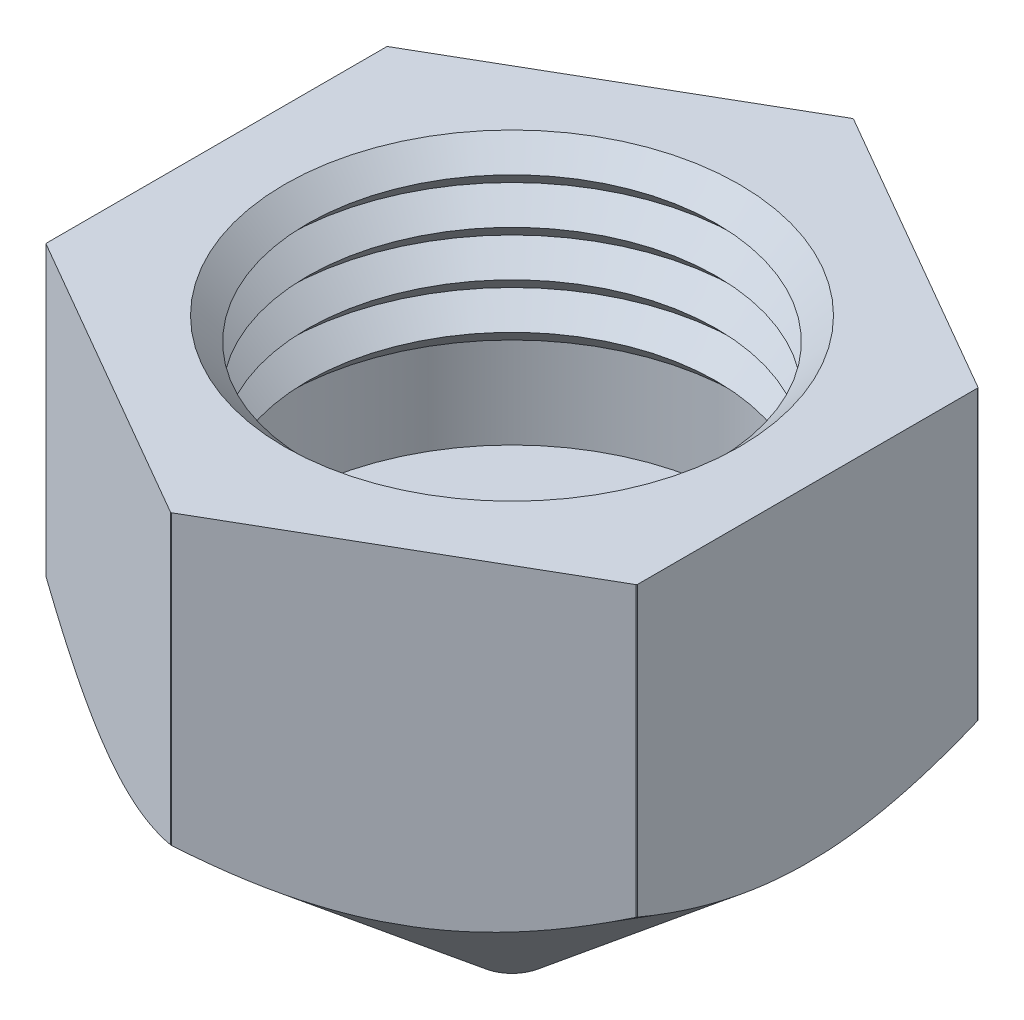
ISO-10303-21;
HEADER;
FILE_DESCRIPTION(('STEP AP214'),'2;1');
FILE_NAME('part.step','',(''),(''),'','','');
FILE_SCHEMA(('AUTOMOTIVE_DESIGN { 1 0 10303 214 1 1 1 1 }'));
ENDSEC;
DATA;
#1=APPLICATION_CONTEXT('core data for automotive mechanical design processes');
#2=APPLICATION_PROTOCOL_DEFINITION('international standard','automotive_design',2000,#1);
#3=PRODUCT_CONTEXT('',#1,'mechanical');
#4=PRODUCT('Part','Part','',(#3));
#5=PRODUCT_RELATED_PRODUCT_CATEGORY('part','',(#4));
#6=PRODUCT_DEFINITION_FORMATION('','',#4);
#7=PRODUCT_DEFINITION_CONTEXT('part definition',#1,'design');
#8=PRODUCT_DEFINITION('design','',#6,#7);
#9=PRODUCT_DEFINITION_SHAPE('','',#8);
#10=(LENGTH_UNIT() NAMED_UNIT(*) SI_UNIT(.MILLI.,.METRE.));
#11=(NAMED_UNIT(*) PLANE_ANGLE_UNIT() SI_UNIT($,.RADIAN.));
#12=(NAMED_UNIT(*) SI_UNIT($,.STERADIAN.) SOLID_ANGLE_UNIT());
#13=UNCERTAINTY_MEASURE_WITH_UNIT(LENGTH_MEASURE(1.E-05),#10,'distance_accuracy_value','');
#14=(GEOMETRIC_REPRESENTATION_CONTEXT(3) GLOBAL_UNCERTAINTY_ASSIGNED_CONTEXT((#13)) GLOBAL_UNIT_ASSIGNED_CONTEXT((#10,
#11,#12)) REPRESENTATION_CONTEXT('',''));
#15=CARTESIAN_POINT('',(0.,0.,0.));
#16=DIRECTION('',(0.,0.,1.));
#17=DIRECTION('',(1.,0.,0.));
#18=AXIS2_PLACEMENT_3D('',#15,#16,#17);
#19=CARTESIAN_POINT('',(7.5,0.,0.));
#20=DIRECTION('',(0.,-1.,0.));
#21=DIRECTION('',(0.,0.,-1.));
#22=AXIS2_PLACEMENT_3D('',#19,#20,#21);
#23=PLANE('',#22);
#24=CARTESIAN_POINT('',(0.,0.,0.));
#25=DIRECTION('',(0.,1.,0.));
#26=DIRECTION('',(0.,0.,1.));
#27=AXIS2_PLACEMENT_3D('',#24,#25,#26);
#28=CIRCLE('',#27,5.);
#29=CARTESIAN_POINT('',(0.,0.,5.));
#30=VERTEX_POINT('',#29);
#31=EDGE_CURVE('E256',#30,#30,#28,.T.);
#32=ORIENTED_EDGE('',*,*,#31,.F.);
#33=EDGE_LOOP('',(#32));
#34=FACE_BOUND('',#33,.T.);
#35=DIRECTION('',(-0.866025403784439,0.,-0.5));
#36=VECTOR('',#35,1.);
#37=CARTESIAN_POINT('',(6.49999999999999,0.,-3.75277674973257));
#38=LINE('',#37,#36);
#39=CARTESIAN_POINT('',(6.49037034920393,0.,-3.75833643121188));
#40=VERTEX_POINT('',#39);
#41=CARTESIAN_POINT('',(0.00962965079606866,0.,-7.49999381798582));
#42=VERTEX_POINT('',#41);
#43=EDGE_CURVE('E187',#40,#42,#38,.T.);
#44=ORIENTED_EDGE('',*,*,#43,.T.);
#45=CARTESIAN_POINT('',(0.,0.,0.));
#46=DIRECTION('',(0.,1.,0.));
#47=DIRECTION('',(0.,0.,1.));
#48=AXIS2_PLACEMENT_3D('',#45,#46,#47);
#49=CIRCLE('',#48,7.5);
#50=CARTESIAN_POINT('',(-0.00962965079606779,0.,-7.49999381798582));
#51=VERTEX_POINT('',#50);
#52=EDGE_CURVE('E186',#42,#51,#49,.T.);
#53=ORIENTED_EDGE('',*,*,#52,.T.);
#54=DIRECTION('',(-0.866025403784439,0.,0.5));
#55=VECTOR('',#54,1.);
#56=CARTESIAN_POINT('',(0.,0.,-7.50555349946513));
#57=LINE('',#56,#55);
#58=CARTESIAN_POINT('',(-6.49037034920393,0.,-3.75833643121188));
#59=VERTEX_POINT('',#58);
#60=EDGE_CURVE('E169',#51,#59,#57,.T.);
#61=ORIENTED_EDGE('',*,*,#60,.T.);
#62=CARTESIAN_POINT('',(-6.5,0.,-3.74165738677395));
#63=VERTEX_POINT('',#62);
#64=EDGE_CURVE('E184',#59,#63,#49,.T.);
#65=ORIENTED_EDGE('',*,*,#64,.T.);
#66=DIRECTION('',(0.,0.,1.));
#67=VECTOR('',#66,1.);
#68=CARTESIAN_POINT('',(-6.5,0.,-3.75277674973257));
#69=LINE('',#68,#67);
#70=CARTESIAN_POINT('',(-6.5,0.,3.74165738677395));
#71=VERTEX_POINT('',#70);
#72=EDGE_CURVE('E102',#63,#71,#69,.T.);
#73=ORIENTED_EDGE('',*,*,#72,.T.);
#74=CARTESIAN_POINT('',(-6.49037034920393,0.,3.75833643121188));
#75=VERTEX_POINT('',#74);
#76=EDGE_CURVE('E190',#71,#75,#49,.T.);
#77=ORIENTED_EDGE('',*,*,#76,.T.);
#78=DIRECTION('',(0.866025403784439,0.,0.5));
#79=VECTOR('',#78,1.);
#80=CARTESIAN_POINT('',(-6.5,0.,3.75277674973257));
#81=LINE('',#80,#79);
#82=CARTESIAN_POINT('',(-0.00962965079606432,0.,7.49999381798582));
#83=VERTEX_POINT('',#82);
#84=EDGE_CURVE('E94',#75,#83,#81,.T.);
#85=ORIENTED_EDGE('',*,*,#84,.T.);
#86=CARTESIAN_POINT('',(0.00962965079606215,0.,7.49999381798582));
#87=VERTEX_POINT('',#86);
#88=EDGE_CURVE('E194',#83,#87,#49,.T.);
#89=ORIENTED_EDGE('',*,*,#88,.T.);
#90=DIRECTION('',(0.866025403784439,0.,-0.5));
#91=VECTOR('',#90,1.);
#92=CARTESIAN_POINT('',(0.,0.,7.50555349946513));
#93=LINE('',#92,#91);
#94=CARTESIAN_POINT('',(6.49037034920393,0.,3.75833643121188));
#95=VERTEX_POINT('',#94);
#96=EDGE_CURVE('E351',#87,#95,#93,.T.);
#97=ORIENTED_EDGE('',*,*,#96,.T.);
#98=CARTESIAN_POINT('',(6.5,0.,3.74165738677395));
#99=VERTEX_POINT('',#98);
#100=EDGE_CURVE('E199',#95,#99,#49,.T.);
#101=ORIENTED_EDGE('',*,*,#100,.T.);
#102=DIRECTION('',(0.,0.,-1.));
#103=VECTOR('',#102,1.);
#104=CARTESIAN_POINT('',(6.49999999999999,0.,3.75277674973257));
#105=LINE('',#104,#103);
#106=CARTESIAN_POINT('',(6.49999999999999,0.,-3.74165738677395));
#107=VERTEX_POINT('',#106);
#108=EDGE_CURVE('E348',#99,#107,#105,.T.);
#109=ORIENTED_EDGE('',*,*,#108,.T.);
#110=EDGE_CURVE('E192',#107,#40,#49,.T.);
#111=ORIENTED_EDGE('',*,*,#110,.T.);
#112=EDGE_LOOP('',(#44,#53,#61,#65,#73,#77,#85,#89,#97,#101,#109,#111));
#113=FACE_BOUND('',#112,.T.);
#114=ADVANCED_FACE('F80',(#34,#113),#23,.F.);
#115=CARTESIAN_POINT('',(0.,-12.,0.));
#116=DIRECTION('',(0.,1.,0.));
#117=DIRECTION('',(0.,0.,1.));
#118=AXIS2_PLACEMENT_3D('',#115,#116,#117);
#119=CONICAL_SURFACE('',#118,0.750000000000002,0.872664625997159);
#120=CARTESIAN_POINT('',(0.,-12.,0.));
#121=DIRECTION('',(0.,1.,0.));
#122=DIRECTION('',(0.,0.,1.));
#123=AXIS2_PLACEMENT_3D('',#120,#121,#122);
#124=CIRCLE('',#123,0.750000000000002);
#125=CARTESIAN_POINT('',(0.,-12.,0.750000000000002));
#126=VERTEX_POINT('',#125);
#127=EDGE_CURVE('E211',#126,#126,#124,.T.);
#128=ORIENTED_EDGE('',*,*,#127,.T.);
#129=EDGE_LOOP('',(#128));
#130=FACE_BOUND('',#129,.T.);
#131=CARTESIAN_POINT('',(6.4907840854015,-6.3358774895533,-3.75809756050684));
#132=CARTESIAN_POINT('',(6.2721804860683,-6.44150504363962,-3.88430840742768));
#133=CARTESIAN_POINT('',(6.05090824172166,-6.54049745093145,-4.01205999726541));
#134=CARTESIAN_POINT('',(5.6024236351629,-6.72140092476843,-4.27099270558951));
#135=CARTESIAN_POINT('',(5.3751943925318,-6.80325577657467,-4.40218356999033));
#136=CARTESIAN_POINT('',(4.91770887370572,-6.94468746843998,-4.66631295743492));
#137=CARTESIAN_POINT('',(4.6874992998961,-7.00446124376274,-4.79922451684394));
#138=CARTESIAN_POINT('',(4.22337398919867,-7.09858830954557,-5.06718738991282));
#139=CARTESIAN_POINT('',(3.98946312385959,-7.13297256776506,-5.20223589098272));
#140=CARTESIAN_POINT('',(3.63527916695337,-7.16363913543257,-5.40672409384517));
#141=CARTESIAN_POINT('',(3.51563429740054,-7.17034133633155,-5.47580109148865));
#142=CARTESIAN_POINT('',(3.27619934370319,-7.17634872611789,-5.61403892645922));
#143=CARTESIAN_POINT('',(3.15640926458357,-7.17565416404938,-5.68319976088518));
#144=CARTESIAN_POINT('',(2.91698970106963,-7.16687178735822,-5.82142871032922));
#145=CARTESIAN_POINT('',(2.79736029310667,-7.15878121919445,-5.89049678121962));
#146=CARTESIAN_POINT('',(2.55862405517319,-7.1354002217659,-6.02833121245584));
#147=CARTESIAN_POINT('',(2.4395173025377,-7.12010876101713,-6.09709752815224));
#148=CARTESIAN_POINT('',(2.08348354616151,-7.0639108989015,-6.30265371323663));
#149=CARTESIAN_POINT('',(1.84774089337108,-7.01267680994404,-6.43875979728466));
#150=CARTESIAN_POINT('',(1.3810925435246,-6.88655390774963,-6.70817934768542));
#151=CARTESIAN_POINT('',(1.1501889234397,-6.81165515044308,-6.8414916148983));
#152=CARTESIAN_POINT('',(0.767152833619516,-6.6698225874224,-7.06263760446532));
#153=CARTESIAN_POINT('',(0.613552997711506,-6.60806447095064,-7.15131851107429));
#154=CARTESIAN_POINT('',(0.385278144896174,-6.5098769964684,-7.28311305879645));
#155=CARTESIAN_POINT('',(0.309677987212163,-6.47628972913643,-7.32676083018609));
#156=CARTESIAN_POINT('',(0.159046111364497,-6.40736914610989,-7.41372818425528));
#157=CARTESIAN_POINT('',(0.0840146000192753,-6.37203522728523,-7.45704764752815));
#158=CARTESIAN_POINT('',(0.00927253307190597,-6.33590486004536,-7.5002));
#159=B_SPLINE_CURVE_WITH_KNOTS('',3,(#131,#132,#133,#134,#135,#136,#137,#138,#139,#140,#141,
#142,#143,#144,#145,#146,#147,#148,#149,#150,#151,#152,#153,#154,#155,#156,#157,#158),
.UNSPECIFIED.,.F.,.F.,(4,2,2,2,2,2,2,2,2,2,2,2,2,4),(0.,0.821225631925539,1.64510425040092,
2.46144657798892,3.27679155533451,3.6915711315783,4.10633674251147,4.5212568340501,
4.93623637845141,5.76584307173045,6.59579883658509,7.15903293242023,7.43961821332753,
7.72030106833482),.UNSPECIFIED.);
#160=CARTESIAN_POINT('',(6.49037034920393,-6.3360774895533,-3.75833643121188));
#161=VERTEX_POINT('',#160);
#162=CARTESIAN_POINT('',(0.00962965079606854,-6.3360774895533,-7.49999381798582));
#163=VERTEX_POINT('',#162);
#164=EDGE_CURVE('E198',#161,#163,#159,.T.);
#165=ORIENTED_EDGE('',*,*,#164,.F.);
#166=CARTESIAN_POINT('',(0.,-6.3360774895533,0.));
#167=DIRECTION('',(0.,1.,0.));
#168=DIRECTION('',(0.,0.,1.));
#169=AXIS2_PLACEMENT_3D('',#166,#167,#168);
#170=CIRCLE('',#169,7.5);
#171=CARTESIAN_POINT('',(6.49999999999999,-6.3360774895533,-3.74165738677395));
#172=VERTEX_POINT('',#171);
#173=EDGE_CURVE('E288',#172,#161,#170,.T.);
#174=ORIENTED_EDGE('',*,*,#173,.F.);
#175=CARTESIAN_POINT('',(6.49999999999999,-4.18104789544403,-7.68894955295264));
#176=CARTESIAN_POINT('',(6.49999999999999,-4.30883968052177,-7.48947703416495));
#177=CARTESIAN_POINT('',(6.49999999999999,-4.43521184115085,-7.28907883452259));
#178=CARTESIAN_POINT('',(6.49999999999999,-4.68446334928344,-6.88605670814282));
#179=CARTESIAN_POINT('',(6.49999999999999,-4.80734183465251,-6.68343224884359));
#180=CARTESIAN_POINT('',(6.49999999999999,-5.04973450887114,-6.27425362063387));
#181=CARTESIAN_POINT('',(6.49999999999999,-5.16921913219222,-6.06768187355713));
#182=CARTESIAN_POINT('',(6.49999999999999,-5.40298006188188,-5.65162065291682));
#183=CARTESIAN_POINT('',(6.49999999999999,-5.51725671032909,-5.44213137217092));
#184=CARTESIAN_POINT('',(6.49999999999999,-5.74403711308446,-5.01105544712995));
#185=CARTESIAN_POINT('',(6.49999999999999,-5.85627224351079,-4.78932672998157));
#186=CARTESIAN_POINT('',(6.49999999999999,-6.07217151771746,-4.34167428480146));
#187=CARTESIAN_POINT('',(6.49999999999999,-6.17583459345196,-4.11575003830403));
#188=CARTESIAN_POINT('',(6.49999999999999,-6.37218593468881,-3.65985387342288));
#189=CARTESIAN_POINT('',(6.49999999999999,-6.46490263841359,-3.42989430967249));
#190=CARTESIAN_POINT('',(6.49999999999999,-6.63705130324292,-2.96509825794761));
#191=CARTESIAN_POINT('',(6.49999999999999,-6.716488123002,-2.73026358911358));
#192=CARTESIAN_POINT('',(6.49999999999999,-6.86088335837456,-2.24969389518852));
#193=CARTESIAN_POINT('',(6.49999999999999,-6.9254298074909,-2.00383314928939));
#194=CARTESIAN_POINT('',(6.49999999999999,-7.03400926189246,-1.50754517189571));
#195=CARTESIAN_POINT('',(6.49999999999999,-7.07804287233455,-1.25711807534128));
#196=CARTESIAN_POINT('',(6.49999999999999,-7.1421387124506,-0.757220847631535));
#197=CARTESIAN_POINT('',(6.49999999999999,-7.16257263339319,-0.507799333693213));
#198=CARTESIAN_POINT('',(6.49999999999999,-7.17919422186389,-0.00813670552531271));
#199=CARTESIAN_POINT('',(6.49999999999999,-7.17538285305941,0.242104375734128));
#200=CARTESIAN_POINT('',(6.49999999999999,-7.14463854484782,0.728125305135748));
#201=CARTESIAN_POINT('',(6.49999999999999,-7.11891135984899,0.96398384387337));
#202=CARTESIAN_POINT('',(6.49999999999999,-7.04762110659611,1.432642653543));
#203=CARTESIAN_POINT('',(6.49999999999999,-7.00205669897426,1.6654427168796));
#204=CARTESIAN_POINT('',(6.49999999999999,-6.89257432837353,2.1313773693949));
#205=CARTESIAN_POINT('',(6.49999999999999,-6.82831945544996,2.36443187709798));
#206=CARTESIAN_POINT('',(6.49999999999999,-6.72068043936283,2.71040336088851));
#207=CARTESIAN_POINT('',(6.49999999999999,-6.68292706522078,2.82511918832867));
#208=CARTESIAN_POINT('',(6.49999999999999,-6.60401360863892,3.0533685426589));
#209=CARTESIAN_POINT('',(6.49999999999999,-6.56285368831806,3.16690212552332));
#210=CARTESIAN_POINT('',(6.49999999999999,-6.42933357928026,3.52013357631982));
#211=CARTESIAN_POINT('',(6.49999999999999,-6.33155684494804,3.75779211747762));
#212=CARTESIAN_POINT('',(6.49999999999999,-6.12491782366153,4.22827086610795));
#213=CARTESIAN_POINT('',(6.49999999999999,-6.01605174829091,4.4610893871724));
#214=CARTESIAN_POINT('',(6.49999999999999,-5.78936617869091,4.92267684764242));
#215=CARTESIAN_POINT('',(6.49999999999999,-5.67153528876963,5.15144016120319));
#216=CARTESIAN_POINT('',(6.49999999999999,-5.42883483782828,5.60514905545123));
#217=CARTESIAN_POINT('',(6.49999999999999,-5.30396604127008,5.83009504733816));
#218=CARTESIAN_POINT('',(6.49999999999999,-5.04772209459481,6.27817963099288));
#219=CARTESIAN_POINT('',(6.49999999999999,-4.91630994358431,6.50129698493104));
#220=CARTESIAN_POINT('',(6.49999999999999,-4.64881671013068,6.94471294484844));
#221=CARTESIAN_POINT('',(6.49999999999999,-4.51273552587779,7.16501148921865));
#222=CARTESIAN_POINT('',(6.49999999999999,-4.23684531445898,7.60304409709067));
#223=CARTESIAN_POINT('',(6.49999999999999,-4.09703892368771,7.82077982485076));
#224=CARTESIAN_POINT('',(6.49999999999999,-3.81426097084963,8.25418850666639));
#225=CARTESIAN_POINT('',(6.49999999999999,-3.67128933871641,8.46986141490732));
#226=CARTESIAN_POINT('',(6.49999999999999,-3.27001154459098,9.06721189002945));
#227=CARTESIAN_POINT('',(6.5,-3.00884744884348,9.44696928729579));
#228=CARTESIAN_POINT('',(6.5,-2.48031314078006,10.2022173009958));
#229=CARTESIAN_POINT('',(6.5,-2.21294186492749,10.5777071695683));
#230=CARTESIAN_POINT('',(6.5,-1.67719069594971,11.320181034519));
#231=CARTESIAN_POINT('',(6.5,-1.40887459775539,11.6872111295245));
#232=CARTESIAN_POINT('',(6.5,-1.00376460453963,12.2357287927036));
#233=CARTESIAN_POINT('',(6.5,-0.868306786427649,12.4182060150929));
#234=CARTESIAN_POINT('',(6.5,-0.596595135917767,12.7825647586762));
#235=CARTESIAN_POINT('',(6.5,-0.460341309694478,12.964446284474));
#236=CARTESIAN_POINT('',(6.5,-0.323735465771332,13.1460631756009));
#237=B_SPLINE_CURVE_WITH_KNOTS('',3,(#175,#176,#177,#178,#179,#180,#181,#182,#183,#184,#185,
#186,#187,#188,#189,#190,#191,#192,#193,#194,#195,#196,#197,#198,#199,#200,#201,#202,#203,#204,
#205,#206,#207,#208,#209,#210,#211,#212,#213,#214,#215,#216,#217,#218,#219,#220,#221,#222,#223,
#224,#225,#226,#227,#228,#229,#230,#231,#232,#233,#234,#235,#236),.UNSPECIFIED.,.F.,.F.,(4,2,2,
2,2,2,2,2,2,2,2,2,2,2,2,2,2,2,2,2,2,2,2,2,2,2,2,2,2,2,4),(0.,0.710704221272361,1.42158232710508,
2.13743579770861,2.85324218049613,3.59864217743046,4.34413490890433,5.0876461526854,
5.83088477300608,6.59271879443871,7.35453033929939,8.10417242192317,8.85378470902174,
9.56463624439037,10.2755357824134,11.0001410577247,11.3624033519917,11.7246484159465,
12.4952111682965,13.2660380540907,14.0378617016225,14.8096016741476,15.5863556337307,
16.3631265414605,17.1393615973211,17.9156138532879,19.2981997230935,20.6810242591412,
22.0449383111869,22.726714378974,23.4084851652517),.UNSPECIFIED.);
#238=CARTESIAN_POINT('',(6.49999999999999,-6.3360774895533,3.74165738677395));
#239=VERTEX_POINT('',#238);
#240=EDGE_CURVE('E291',#239,#172,#237,.F.);
#241=ORIENTED_EDGE('',*,*,#240,.F.);
#242=CARTESIAN_POINT('',(6.49037034920393,-6.3360774895533,3.75833643121188));
#243=VERTEX_POINT('',#242);
#244=EDGE_CURVE('E210',#243,#239,#170,.T.);
#245=ORIENTED_EDGE('',*,*,#244,.F.);
#246=CARTESIAN_POINT('',(0.00927253307190107,-6.33590486004536,7.5002));
#247=CARTESIAN_POINT('',(0.227875069587016,-6.44153052192981,7.37398976669746));
#248=CARTESIAN_POINT('',(0.44914624132368,-6.54052097285652,7.2462387961314));
#249=CARTESIAN_POINT('',(0.897628616126188,-6.72142044466033,6.98730737631237));
#250=CARTESIAN_POINT('',(1.12485669901551,-6.8032732518157,6.85611718148877));
#251=CARTESIAN_POINT('',(1.58233964427547,-6.94470080603535,6.59198927989327));
#252=CARTESIAN_POINT('',(1.812547802001,-7.00447250251679,6.45907853806079));
#253=CARTESIAN_POINT('',(2.27667011984351,-7.09859555567307,6.19111739291751));
#254=CARTESIAN_POINT('',(2.51057940868206,-7.13297787950761,6.05606980204061));
#255=CARTESIAN_POINT('',(2.86476079099091,-7.16364176249771,5.85158308562264));
#256=CARTESIAN_POINT('',(2.98440472452815,-7.17034309953433,5.78250662838801));
#257=CARTESIAN_POINT('',(3.22383776773693,-7.17634887416223,5.64426989643853));
#258=CARTESIAN_POINT('',(3.34362687238517,-7.17565356077924,5.57510962462389));
#259=CARTESIAN_POINT('',(3.58304445705223,-7.1668698114583,5.43688181766763));
#260=CARTESIAN_POINT('',(3.70267286062747,-7.15877862199183,5.36781432666074));
#261=CARTESIAN_POINT('',(3.94140707058154,-7.13539652253401,5.22998106627898));
#262=CARTESIAN_POINT('',(4.06051279962334,-7.1201045810884,5.16121534155467));
#263=CARTESIAN_POINT('',(4.41654356340797,-7.06390548086904,4.95566088424383));
#264=CARTESIAN_POINT('',(4.6522842332203,-7.01267084166236,4.81955594506874));
#265=CARTESIAN_POINT('',(5.11892866144344,-6.88654735061677,4.55013865881827));
#266=CARTESIAN_POINT('',(5.34983034287447,-6.81164855479408,4.41682751088773));
#267=CARTESIAN_POINT('',(5.73287132486937,-6.66981327646954,4.19567869682231));
#268=CARTESIAN_POINT('',(5.88647783716676,-6.60805191377943,4.10699393559813));
#269=CARTESIAN_POINT('',(6.11476251178885,-6.50985915721846,3.9751937172532));
#270=CARTESIAN_POINT('',(6.19036589599476,-6.47627006877033,3.93154408303028));
#271=CARTESIAN_POINT('',(6.34100417563884,-6.40734571947261,3.84457303172751));
#272=CARTESIAN_POINT('',(6.41603886424724,-6.37200985546713,3.80125173406089));
#273=CARTESIAN_POINT('',(6.4907840854015,-6.3358774895533,3.75809756050684));
#274=B_SPLINE_CURVE_WITH_KNOTS('',3,(#246,#247,#248,#249,#250,#251,#252,#253,#254,#255,#256,
#257,#258,#259,#260,#261,#262,#263,#264,#265,#266,#267,#268,#269,#270,#271,#272,#273),
.UNSPECIFIED.,.F.,.F.,(4,2,2,2,2,2,2,2,2,2,2,2,2,4),(0.,0.821220040359956,1.64509298964492,
2.46142916308132,3.27676800754026,3.69154422346683,4.10630647501497,4.52122320793188,
4.93619939267721,5.76579968450091,6.59574904975898,7.15900816344463,7.439605836332,
7.72030108484042),.UNSPECIFIED.);
#275=CARTESIAN_POINT('',(0.00962965079606215,-6.3360774895533,7.49999381798582));
#276=VERTEX_POINT('',#275);
#277=EDGE_CURVE('E310',#276,#243,#274,.T.);
#278=ORIENTED_EDGE('',*,*,#277,.F.);
#279=CARTESIAN_POINT('',(-0.0096296507960617,-6.3360774895533,7.49999381798582));
#280=VERTEX_POINT('',#279);
#281=EDGE_CURVE('E206',#280,#276,#170,.T.);
#282=ORIENTED_EDGE('',*,*,#281,.F.);
#283=CARTESIAN_POINT('',(-6.4907840854015,-6.3358774895533,3.75809756050683));
#284=CARTESIAN_POINT('',(-6.27218048606831,-6.44150504363962,3.88430840742767));
#285=CARTESIAN_POINT('',(-6.05090824172167,-6.54049745093145,4.0120599972654));
#286=CARTESIAN_POINT('',(-5.6024236351629,-6.72140092476843,4.27099270558951));
#287=CARTESIAN_POINT('',(-5.37519439253181,-6.80325577657467,4.40218356999032));
#288=CARTESIAN_POINT('',(-4.91770887370573,-6.94468746843999,4.66631295743492));
#289=CARTESIAN_POINT('',(-4.68749929989611,-7.00446124376275,4.79922451684393));
#290=CARTESIAN_POINT('',(-4.22337398919867,-7.09858830954558,5.06718738991281));
#291=CARTESIAN_POINT('',(-3.98946312385959,-7.13297256776507,5.20223589098271));
#292=CARTESIAN_POINT('',(-3.63527916695337,-7.16363913543257,5.40672409384516));
#293=CARTESIAN_POINT('',(-3.51563429740054,-7.17034133633155,5.47580109148865));
#294=CARTESIAN_POINT('',(-3.27619934370319,-7.17634872611789,5.61403892645922));
#295=CARTESIAN_POINT('',(-3.15640926458357,-7.17565416404938,5.68319976088518));
#296=CARTESIAN_POINT('',(-2.91698970106963,-7.16687178735823,5.82142871032921));
#297=CARTESIAN_POINT('',(-2.79736029310667,-7.15878121919445,5.89049678121962));
#298=CARTESIAN_POINT('',(-2.55862405517319,-7.1354002217659,6.02833121245584));
#299=CARTESIAN_POINT('',(-2.4395173025377,-7.12010876101714,6.09709752815224));
#300=CARTESIAN_POINT('',(-2.08348354616152,-7.06391089890151,6.30265371323662));
#301=CARTESIAN_POINT('',(-1.84774089337108,-7.01267680994404,6.43875979728465));
#302=CARTESIAN_POINT('',(-1.3810925435246,-6.88655390774964,6.70817934768542));
#303=CARTESIAN_POINT('',(-1.1501889234397,-6.81165515044309,6.84149161489829));
#304=CARTESIAN_POINT('',(-0.767152833619515,-6.6698225874224,7.06263760446532));
#305=CARTESIAN_POINT('',(-0.613552997711503,-6.60806447095064,7.15131851107429));
#306=CARTESIAN_POINT('',(-0.38527814489617,-6.5098769964684,7.28311305879645));
#307=CARTESIAN_POINT('',(-0.309677987212158,-6.47628972913643,7.32676083018609));
#308=CARTESIAN_POINT('',(-0.159046111364491,-6.40736914610989,7.41372818425528));
#309=CARTESIAN_POINT('',(-0.0840146000192681,-6.37203522728523,7.45704764752815));
#310=CARTESIAN_POINT('',(-0.00927253307189885,-6.33590486004536,7.5002));
#311=B_SPLINE_CURVE_WITH_KNOTS('',3,(#283,#284,#285,#286,#287,#288,#289,#290,#291,#292,#293,
#294,#295,#296,#297,#298,#299,#300,#301,#302,#303,#304,#305,#306,#307,#308,#309,#310),
.UNSPECIFIED.,.F.,.F.,(4,2,2,2,2,2,2,2,2,2,2,2,2,4),(0.,0.821225631925538,1.64510425040092,
2.46144657798892,3.27679155533451,3.69157113157831,4.10633674251147,4.52125683405011,
4.93623637845142,5.76584307173045,6.5957988365851,7.15903293242024,7.43961821332754,
7.72030106833483),.UNSPECIFIED.);
#312=CARTESIAN_POINT('',(-6.49037034920393,-6.3360774895533,3.75833643121188));
#313=VERTEX_POINT('',#312);
#314=EDGE_CURVE('E307',#313,#280,#311,.T.);
#315=ORIENTED_EDGE('',*,*,#314,.F.);
#316=CARTESIAN_POINT('',(-6.5,-6.33607748955334,3.74165738677413));
#317=VERTEX_POINT('',#316);
#318=EDGE_CURVE('E209',#317,#313,#170,.T.);
#319=ORIENTED_EDGE('',*,*,#318,.F.);
#320=CARTESIAN_POINT('',(-6.5,-4.18104789544403,-7.68894955295263));
#321=CARTESIAN_POINT('',(-6.5,-4.30883968052177,-7.48947703416494));
#322=CARTESIAN_POINT('',(-6.5,-4.43521184115086,-7.28907883452258));
#323=CARTESIAN_POINT('',(-6.5,-4.68446334928345,-6.88605670814281));
#324=CARTESIAN_POINT('',(-6.5,-4.80734183465251,-6.68343224884358));
#325=CARTESIAN_POINT('',(-6.5,-5.04973450887114,-6.27425362063387));
#326=CARTESIAN_POINT('',(-6.5,-5.16921913219223,-6.06768187355713));
#327=CARTESIAN_POINT('',(-6.5,-5.40298006188188,-5.65162065291682));
#328=CARTESIAN_POINT('',(-6.5,-5.51725671032909,-5.44213137217091));
#329=CARTESIAN_POINT('',(-6.5,-5.74403711308446,-5.01105544712994));
#330=CARTESIAN_POINT('',(-6.5,-5.85627224351079,-4.78932672998157));
#331=CARTESIAN_POINT('',(-6.5,-6.07217151771746,-4.34167428480145));
#332=CARTESIAN_POINT('',(-6.5,-6.17583459345196,-4.11575003830403));
#333=CARTESIAN_POINT('',(-6.5,-6.37218593468881,-3.65985387342288));
#334=CARTESIAN_POINT('',(-6.5,-6.46490263841359,-3.42989430967248));
#335=CARTESIAN_POINT('',(-6.5,-6.63705130324292,-2.9650982579476));
#336=CARTESIAN_POINT('',(-6.5,-6.716488123002,-2.73026358911357));
#337=CARTESIAN_POINT('',(-6.5,-6.86088335837455,-2.24969389518852));
#338=CARTESIAN_POINT('',(-6.5,-6.9254298074909,-2.00383314928939));
#339=CARTESIAN_POINT('',(-6.5,-7.03400926189246,-1.5075451718957));
#340=CARTESIAN_POINT('',(-6.5,-7.07804287233455,-1.25711807534128));
#341=CARTESIAN_POINT('',(-6.5,-7.1421387124506,-0.757220847631533));
#342=CARTESIAN_POINT('',(-6.5,-7.16257263339319,-0.50779933369321));
#343=CARTESIAN_POINT('',(-6.5,-7.17919422186389,-0.00813670552530995));
#344=CARTESIAN_POINT('',(-6.5,-7.17538285305941,0.242104375734131));
#345=CARTESIAN_POINT('',(-6.5,-7.14463854484782,0.728125305135751));
#346=CARTESIAN_POINT('',(-6.5,-7.11891135984899,0.963983843873373));
#347=CARTESIAN_POINT('',(-6.5,-7.04762110659611,1.43264265354301));
#348=CARTESIAN_POINT('',(-6.5,-7.00205669897426,1.66544271687961));
#349=CARTESIAN_POINT('',(-6.5,-6.89257432837353,2.13137736939491));
#350=CARTESIAN_POINT('',(-6.5,-6.82831945544996,2.36443187709798));
#351=CARTESIAN_POINT('',(-6.5,-6.72068043936283,2.71040336088851));
#352=CARTESIAN_POINT('',(-6.5,-6.68292706522078,2.82511918832867));
#353=CARTESIAN_POINT('',(-6.5,-6.60401360863891,3.0533685426589));
#354=CARTESIAN_POINT('',(-6.5,-6.56285368831805,3.16690212552332));
#355=CARTESIAN_POINT('',(-6.5,-6.42933357928026,3.52013357631983));
#356=CARTESIAN_POINT('',(-6.5,-6.33155684494804,3.75779211747762));
#357=CARTESIAN_POINT('',(-6.5,-6.12491782366153,4.22827086610795));
#358=CARTESIAN_POINT('',(-6.5,-6.01605174829091,4.4610893871724));
#359=CARTESIAN_POINT('',(-6.5,-5.78936617869091,4.92267684764242));
#360=CARTESIAN_POINT('',(-6.5,-5.67153528876963,5.15144016120319));
#361=CARTESIAN_POINT('',(-6.5,-5.42883483782828,5.60514905545123));
#362=CARTESIAN_POINT('',(-6.5,-5.30396604127007,5.83009504733817));
#363=CARTESIAN_POINT('',(-6.5,-5.04772209459481,6.27817963099289));
#364=CARTESIAN_POINT('',(-6.5,-4.91630994358431,6.50129698493104));
#365=CARTESIAN_POINT('',(-6.5,-4.64881671013068,6.94471294484844));
#366=CARTESIAN_POINT('',(-6.5,-4.51273552587779,7.16501148921865));
#367=CARTESIAN_POINT('',(-6.5,-4.23684531445897,7.60304409709067));
#368=CARTESIAN_POINT('',(-6.5,-4.09703892368771,7.82077982485076));
#369=CARTESIAN_POINT('',(-6.5,-3.81426097084963,8.2541885066664));
#370=CARTESIAN_POINT('',(-6.5,-3.6712893387164,8.46986141490733));
#371=CARTESIAN_POINT('',(-6.5,-3.27001154459098,9.06721189002946));
#372=CARTESIAN_POINT('',(-6.5,-3.00884744884347,9.44696928729579));
#373=CARTESIAN_POINT('',(-6.5,-2.48031314078005,10.2022173009958));
#374=CARTESIAN_POINT('',(-6.5,-2.21294186492748,10.5777071695683));
#375=CARTESIAN_POINT('',(-6.5,-1.6771906959497,11.320181034519));
#376=CARTESIAN_POINT('',(-6.5,-1.40887459775538,11.6872111295245));
#377=CARTESIAN_POINT('',(-6.5,-1.00376460453962,12.2357287927036));
#378=CARTESIAN_POINT('',(-6.5,-0.868306786427639,12.4182060150929));
#379=CARTESIAN_POINT('',(-6.5,-0.596595135917757,12.7825647586762));
#380=CARTESIAN_POINT('',(-6.5,-0.460341309694466,12.964446284474));
#381=CARTESIAN_POINT('',(-6.5,-0.323735465771319,13.146063175601));
#382=B_SPLINE_CURVE_WITH_KNOTS('',3,(#320,#321,#322,#323,#324,#325,#326,#327,#328,#329,#330,
#331,#332,#333,#334,#335,#336,#337,#338,#339,#340,#341,#342,#343,#344,#345,#346,#347,#348,#349,
#350,#351,#352,#353,#354,#355,#356,#357,#358,#359,#360,#361,#362,#363,#364,#365,#366,#367,#368,
#369,#370,#371,#372,#373,#374,#375,#376,#377,#378,#379,#380,#381),.UNSPECIFIED.,.F.,.F.,(4,2,2,
2,2,2,2,2,2,2,2,2,2,2,2,2,2,2,2,2,2,2,2,2,2,2,2,2,2,2,4),(0.,0.710704221272363,1.42158232710508,
2.13743579770861,2.85324218049613,3.59864217743046,4.34413490890433,5.08764615268539,
5.83088477300607,6.5927187944387,7.35453033929938,8.10417242192317,8.85378470902174,
9.56463624439037,10.2755357824134,11.0001410577247,11.3624033519917,11.7246484159465,
12.4952111682965,13.2660380540907,14.0378617016225,14.8096016741476,15.5863556337307,
16.3631265414605,17.1393615973211,17.9156138532879,19.2981997230935,20.6810242591412,
22.0449383111869,22.726714378974,23.4084851652517),.UNSPECIFIED.);
#383=CARTESIAN_POINT('',(-6.5,-6.3360774895533,-3.74165738677395));
#384=VERTEX_POINT('',#383);
#385=EDGE_CURVE('E305',#384,#317,#382,.T.);
#386=ORIENTED_EDGE('',*,*,#385,.F.);
#387=CARTESIAN_POINT('',(-6.49037034920393,-6.3360774895533,-3.75833643121188));
#388=VERTEX_POINT('',#387);
#389=EDGE_CURVE('E295',#388,#384,#170,.T.);
#390=ORIENTED_EDGE('',*,*,#389,.F.);
#391=CARTESIAN_POINT('',(-0.00927253307190846,-6.33590486004536,-7.5002));
#392=CARTESIAN_POINT('',(-0.227875069587025,-6.44153052192981,-7.37398976669746));
#393=CARTESIAN_POINT('',(-0.449146241323689,-6.54052097285651,-7.2462387961314));
#394=CARTESIAN_POINT('',(-0.897628616126197,-6.72142044466033,-6.98730737631236));
#395=CARTESIAN_POINT('',(-1.12485669901552,-6.8032732518157,-6.85611718148877));
#396=CARTESIAN_POINT('',(-1.58233964427547,-6.94470080603535,-6.59198927989327));
#397=CARTESIAN_POINT('',(-1.81254780200101,-7.00447250251679,-6.45907853806079));
#398=CARTESIAN_POINT('',(-2.27667011984351,-7.09859555567307,-6.1911173929175));
#399=CARTESIAN_POINT('',(-2.51057940868206,-7.13297787950761,-6.05606980204061));
#400=CARTESIAN_POINT('',(-2.86476079099092,-7.16364176249771,-5.85158308562264));
#401=CARTESIAN_POINT('',(-2.98440472452816,-7.17034309953433,-5.78250662838801));
#402=CARTESIAN_POINT('',(-3.22383776773693,-7.17634887416222,-5.64426989643853));
#403=CARTESIAN_POINT('',(-3.34362687238518,-7.17565356077923,-5.57510962462389));
#404=CARTESIAN_POINT('',(-3.58304445705223,-7.16686981145829,-5.43688181766763));
#405=CARTESIAN_POINT('',(-3.70267286062747,-7.15877862199183,-5.36781432666074));
#406=CARTESIAN_POINT('',(-3.94140707058155,-7.135396522534,-5.22998106627898));
#407=CARTESIAN_POINT('',(-4.06051279962335,-7.1201045810884,-5.16121534155467));
#408=CARTESIAN_POINT('',(-4.41654356340797,-7.06390548086904,-4.95566088424383));
#409=CARTESIAN_POINT('',(-4.65228423322031,-7.01267084166235,-4.81955594506874));
#410=CARTESIAN_POINT('',(-5.11892866144345,-6.88654735061677,-4.55013865881827));
#411=CARTESIAN_POINT('',(-5.34983034287447,-6.81164855479407,-4.41682751088773));
#412=CARTESIAN_POINT('',(-5.73287132486938,-6.66981327646953,-4.19567869682231));
#413=CARTESIAN_POINT('',(-5.88647783716677,-6.60805191377943,-4.10699393559814));
#414=CARTESIAN_POINT('',(-6.11476251178885,-6.50985915721846,-3.97519371725321));
#415=CARTESIAN_POINT('',(-6.19036589599476,-6.47627006877033,-3.93154408303028));
#416=CARTESIAN_POINT('',(-6.34100417563884,-6.40734571947261,-3.84457303172751));
#417=CARTESIAN_POINT('',(-6.41603886424724,-6.37200985546713,-3.80125173406089));
#418=CARTESIAN_POINT('',(-6.4907840854015,-6.3358774895533,-3.75809756050684));
#419=B_SPLINE_CURVE_WITH_KNOTS('',3,(#391,#392,#393,#394,#395,#396,#397,#398,#399,#400,#401,
#402,#403,#404,#405,#406,#407,#408,#409,#410,#411,#412,#413,#414,#415,#416,#417,#418),
.UNSPECIFIED.,.F.,.F.,(4,2,2,2,2,2,2,2,2,2,2,2,2,4),(0.,0.821220040359957,1.64509298964493,
2.46142916308132,3.27676800754026,3.69154422346683,4.10630647501497,4.52122320793188,
4.93619939267721,5.7657996845009,6.59574904975898,7.15900816344462,7.43960583633199,
7.7203010848404),.UNSPECIFIED.);
#420=CARTESIAN_POINT('',(-0.00962965079606779,-6.3360774895533,-7.49999381798582));
#421=VERTEX_POINT('',#420);
#422=EDGE_CURVE('E172',#421,#388,#419,.T.);
#423=ORIENTED_EDGE('',*,*,#422,.F.);
#424=EDGE_CURVE('E290',#163,#421,#170,.T.);
#425=ORIENTED_EDGE('',*,*,#424,.F.);
#426=EDGE_LOOP('',(#165,#174,#241,#245,#278,#282,#315,#319,#386,#390,#423,#425));
#427=FACE_BOUND('',#426,.T.);
#428=ADVANCED_FACE('F286',(#130,#427),#119,.T.);
#429=CARTESIAN_POINT('',(0.,0.,0.));
#430=DIRECTION('',(0.,1.,0.));
#431=DIRECTION('',(0.,0.,1.));
#432=AXIS2_PLACEMENT_3D('',#429,#430,#431);
#433=CYLINDRICAL_SURFACE('',#432,7.5);
#434=DIRECTION('',(0.,1.,0.));
#435=VECTOR('',#434,1.);
#436=CARTESIAN_POINT('',(0.00962965079606736,0.,-7.49999381798582));
#437=LINE('',#436,#435);
#438=EDGE_CURVE('E15',#163,#42,#437,.T.);
#439=ORIENTED_EDGE('',*,*,#438,.F.);
#440=ORIENTED_EDGE('',*,*,#424,.T.);
#441=DIRECTION('',(0.,1.,0.));
#442=VECTOR('',#441,1.);
#443=CARTESIAN_POINT('',(-0.00962965079606779,0.,-7.49999381798582));
#444=LINE('',#443,#442);
#445=EDGE_CURVE('E178',#51,#421,#444,.F.);
#446=ORIENTED_EDGE('',*,*,#445,.F.);
#447=ORIENTED_EDGE('',*,*,#52,.F.);
#448=EDGE_LOOP('',(#439,#440,#446,#447));
#449=FACE_BOUND('',#448,.T.);
#450=ADVANCED_FACE('F356',(#449),#433,.T.);
#451=DIRECTION('',(0.,1.,0.));
#452=VECTOR('',#451,1.);
#453=CARTESIAN_POINT('',(6.49037034920393,0.,-3.75833643121188));
#454=LINE('',#453,#452);
#455=EDGE_CURVE('E87',#40,#161,#454,.F.);
#456=ORIENTED_EDGE('',*,*,#455,.F.);
#457=ORIENTED_EDGE('',*,*,#110,.F.);
#458=DIRECTION('',(0.,1.,0.));
#459=VECTOR('',#458,1.);
#460=CARTESIAN_POINT('',(6.49999999999999,0.,-3.74165738677395));
#461=LINE('',#460,#459);
#462=EDGE_CURVE('E273',#172,#107,#461,.T.);
#463=ORIENTED_EDGE('',*,*,#462,.F.);
#464=ORIENTED_EDGE('',*,*,#173,.T.);
#465=EDGE_LOOP('',(#456,#457,#463,#464));
#466=FACE_BOUND('',#465,.T.);
#467=ADVANCED_FACE('F293',(#466),#433,.T.);
#468=DIRECTION('',(0.,1.,0.));
#469=VECTOR('',#468,1.);
#470=CARTESIAN_POINT('',(6.49999999999999,0.,3.74165738677395));
#471=LINE('',#470,#469);
#472=EDGE_CURVE('E271',#99,#239,#471,.F.);
#473=ORIENTED_EDGE('',*,*,#472,.F.);
#474=ORIENTED_EDGE('',*,*,#100,.F.);
#475=DIRECTION('',(0.,1.,0.));
#476=VECTOR('',#475,1.);
#477=CARTESIAN_POINT('',(6.49037034920393,0.,3.75833643121188));
#478=LINE('',#477,#476);
#479=EDGE_CURVE('E269',#243,#95,#478,.T.);
#480=ORIENTED_EDGE('',*,*,#479,.F.);
#481=ORIENTED_EDGE('',*,*,#244,.T.);
#482=EDGE_LOOP('',(#473,#474,#480,#481));
#483=FACE_BOUND('',#482,.T.);
#484=ADVANCED_FACE('F362',(#483),#433,.T.);
#485=DIRECTION('',(0.,1.,0.));
#486=VECTOR('',#485,1.);
#487=CARTESIAN_POINT('',(0.00962965079606215,0.,7.49999381798582));
#488=LINE('',#487,#486);
#489=EDGE_CURVE('E267',#87,#276,#488,.F.);
#490=ORIENTED_EDGE('',*,*,#489,.F.);
#491=ORIENTED_EDGE('',*,*,#88,.F.);
#492=DIRECTION('',(0.,1.,0.));
#493=VECTOR('',#492,1.);
#494=CARTESIAN_POINT('',(-0.00962965079606432,0.,7.49999381798582));
#495=LINE('',#494,#493);
#496=EDGE_CURVE('E265',#280,#83,#495,.T.);
#497=ORIENTED_EDGE('',*,*,#496,.F.);
#498=ORIENTED_EDGE('',*,*,#281,.T.);
#499=EDGE_LOOP('',(#490,#491,#497,#498));
#500=FACE_BOUND('',#499,.T.);
#501=ADVANCED_FACE('F532',(#500),#433,.T.);
#502=DIRECTION('',(0.,1.,0.));
#503=VECTOR('',#502,1.);
#504=CARTESIAN_POINT('',(-6.49037034920393,0.,3.75833643121188));
#505=LINE('',#504,#503);
#506=EDGE_CURVE('E263',#75,#313,#505,.F.);
#507=ORIENTED_EDGE('',*,*,#506,.F.);
#508=ORIENTED_EDGE('',*,*,#76,.F.);
#509=DIRECTION('',(0.,1.,0.));
#510=VECTOR('',#509,1.);
#511=CARTESIAN_POINT('',(-6.5,0.,3.74165738677395));
#512=LINE('',#511,#510);
#513=EDGE_CURVE('E261',#317,#71,#512,.T.);
#514=ORIENTED_EDGE('',*,*,#513,.F.);
#515=ORIENTED_EDGE('',*,*,#318,.T.);
#516=EDGE_LOOP('',(#507,#508,#514,#515));
#517=FACE_BOUND('',#516,.T.);
#518=ADVANCED_FACE('F301',(#517),#433,.T.);
#519=DIRECTION('',(0.,1.,0.));
#520=VECTOR('',#519,1.);
#521=CARTESIAN_POINT('',(-6.5,0.,-3.74165738677395));
#522=LINE('',#521,#520);
#523=EDGE_CURVE('E177',#63,#384,#522,.F.);
#524=ORIENTED_EDGE('',*,*,#523,.F.);
#525=ORIENTED_EDGE('',*,*,#64,.F.);
#526=DIRECTION('',(0.,1.,0.));
#527=VECTOR('',#526,1.);
#528=CARTESIAN_POINT('',(-6.49037034920393,0.,-3.75833643121188));
#529=LINE('',#528,#527);
#530=EDGE_CURVE('E166',#388,#59,#529,.T.);
#531=ORIENTED_EDGE('',*,*,#530,.F.);
#532=ORIENTED_EDGE('',*,*,#389,.T.);
#533=EDGE_LOOP('',(#524,#525,#531,#532));
#534=FACE_BOUND('',#533,.T.);
#535=ADVANCED_FACE('F189',(#534),#433,.T.);
#536=CARTESIAN_POINT('',(0.,0.,0.));
#537=DIRECTION('',(0.,1.,0.));
#538=DIRECTION('',(0.,0.,1.));
#539=AXIS2_PLACEMENT_3D('',#536,#537,#538);
#540=CONICAL_SURFACE('',#539,5.,0.785398163397442);
#541=CARTESIAN_POINT('',(0.,-0.500000000000013,0.));
#542=DIRECTION('',(0.,1.,0.));
#543=DIRECTION('',(0.,0.,1.));
#544=AXIS2_PLACEMENT_3D('',#541,#542,#543);
#545=CIRCLE('',#544,4.5);
#546=CARTESIAN_POINT('',(0.,-0.500000000000013,4.5));
#547=VERTEX_POINT('',#546);
#548=EDGE_CURVE('E253',#547,#547,#545,.T.);
#549=ORIENTED_EDGE('',*,*,#548,.F.);
#550=EDGE_LOOP('',(#549));
#551=FACE_BOUND('',#550,.T.);
#552=ORIENTED_EDGE('',*,*,#31,.T.);
#553=EDGE_LOOP('',(#552));
#554=FACE_BOUND('',#553,.T.);
#555=ADVANCED_FACE('F365',(#551,#554),#540,.F.);
#556=CARTESIAN_POINT('',(0.,-0.500000000000013,0.));
#557=DIRECTION('',(0.,-1.,0.));
#558=DIRECTION('',(0.,0.,-1.));
#559=AXIS2_PLACEMENT_3D('',#556,#557,#558);
#560=CONICAL_SURFACE('',#559,4.5,0.785398163397463);
#561=CARTESIAN_POINT('',(0.,-1.,0.));
#562=DIRECTION('',(0.,1.,0.));
#563=DIRECTION('',(0.,0.,1.));
#564=AXIS2_PLACEMENT_3D('',#561,#562,#563);
#565=CIRCLE('',#564,5.);
#566=CARTESIAN_POINT('',(0.,-1.,5.));
#567=VERTEX_POINT('',#566);
#568=EDGE_CURVE('E250',#567,#567,#565,.T.);
#569=ORIENTED_EDGE('',*,*,#568,.F.);
#570=EDGE_LOOP('',(#569));
#571=FACE_BOUND('',#570,.T.);
#572=ORIENTED_EDGE('',*,*,#548,.T.);
#573=EDGE_LOOP('',(#572));
#574=FACE_BOUND('',#573,.T.);
#575=ADVANCED_FACE('F373',(#571,#574),#560,.F.);
#576=CARTESIAN_POINT('',(0.,-1.,0.));
#577=DIRECTION('',(0.,1.,0.));
#578=DIRECTION('',(0.,0.,1.));
#579=AXIS2_PLACEMENT_3D('',#576,#577,#578);
#580=CONICAL_SURFACE('',#579,5.,0.785398163397442);
#581=CARTESIAN_POINT('',(0.,-1.50000000000001,0.));
#582=DIRECTION('',(0.,1.,0.));
#583=DIRECTION('',(0.,0.,1.));
#584=AXIS2_PLACEMENT_3D('',#581,#582,#583);
#585=CIRCLE('',#584,4.5);
#586=CARTESIAN_POINT('',(0.,-1.50000000000001,4.5));
#587=VERTEX_POINT('',#586);
#588=EDGE_CURVE('E247',#587,#587,#585,.T.);
#589=ORIENTED_EDGE('',*,*,#588,.F.);
#590=EDGE_LOOP('',(#589));
#591=FACE_BOUND('',#590,.T.);
#592=ORIENTED_EDGE('',*,*,#568,.T.);
#593=EDGE_LOOP('',(#592));
#594=FACE_BOUND('',#593,.T.);
#595=ADVANCED_FACE('F378',(#591,#594),#580,.F.);
#596=CARTESIAN_POINT('',(0.,-1.50000000000001,0.));
#597=DIRECTION('',(0.,-1.,0.));
#598=DIRECTION('',(0.,0.,-1.));
#599=AXIS2_PLACEMENT_3D('',#596,#597,#598);
#600=CONICAL_SURFACE('',#599,4.5,0.785398163397463);
#601=CARTESIAN_POINT('',(0.,-2.,0.));
#602=DIRECTION('',(0.,1.,0.));
#603=DIRECTION('',(0.,0.,1.));
#604=AXIS2_PLACEMENT_3D('',#601,#602,#603);
#605=CIRCLE('',#604,5.);
#606=CARTESIAN_POINT('',(0.,-2.,5.));
#607=VERTEX_POINT('',#606);
#608=EDGE_CURVE('E244',#607,#607,#605,.T.);
#609=ORIENTED_EDGE('',*,*,#608,.F.);
#610=EDGE_LOOP('',(#609));
#611=FACE_BOUND('',#610,.T.);
#612=ORIENTED_EDGE('',*,*,#588,.T.);
#613=EDGE_LOOP('',(#612));
#614=FACE_BOUND('',#613,.T.);
#615=ADVANCED_FACE('F385',(#611,#614),#600,.F.);
#616=CARTESIAN_POINT('',(0.,-2.,0.));
#617=DIRECTION('',(0.,1.,0.));
#618=DIRECTION('',(0.,0.,1.));
#619=AXIS2_PLACEMENT_3D('',#616,#617,#618);
#620=CONICAL_SURFACE('',#619,5.,0.785398163397441);
#621=CARTESIAN_POINT('',(0.,-2.50000000000001,0.));
#622=DIRECTION('',(0.,1.,0.));
#623=DIRECTION('',(0.,0.,1.));
#624=AXIS2_PLACEMENT_3D('',#621,#622,#623);
#625=CIRCLE('',#624,4.5);
#626=CARTESIAN_POINT('',(0.,-2.50000000000001,4.5));
#627=VERTEX_POINT('',#626);
#628=EDGE_CURVE('E241',#627,#627,#625,.T.);
#629=ORIENTED_EDGE('',*,*,#628,.F.);
#630=EDGE_LOOP('',(#629));
#631=FACE_BOUND('',#630,.T.);
#632=ORIENTED_EDGE('',*,*,#608,.T.);
#633=EDGE_LOOP('',(#632));
#634=FACE_BOUND('',#633,.T.);
#635=ADVANCED_FACE('F389',(#631,#634),#620,.F.);
#636=CARTESIAN_POINT('',(0.,-2.50000000000001,0.));
#637=DIRECTION('',(0.,-1.,0.));
#638=DIRECTION('',(0.,0.,-1.));
#639=AXIS2_PLACEMENT_3D('',#636,#637,#638);
#640=CONICAL_SURFACE('',#639,4.5,0.785398163397461);
#641=CARTESIAN_POINT('',(0.,-3.,0.));
#642=DIRECTION('',(0.,1.,0.));
#643=DIRECTION('',(0.,0.,1.));
#644=AXIS2_PLACEMENT_3D('',#641,#642,#643);
#645=CIRCLE('',#644,5.);
#646=CARTESIAN_POINT('',(0.,-3.,5.));
#647=VERTEX_POINT('',#646);
#648=EDGE_CURVE('E238',#647,#647,#645,.T.);
#649=ORIENTED_EDGE('',*,*,#648,.F.);
#650=EDGE_LOOP('',(#649));
#651=FACE_BOUND('',#650,.T.);
#652=ORIENTED_EDGE('',*,*,#628,.T.);
#653=EDGE_LOOP('',(#652));
#654=FACE_BOUND('',#653,.T.);
#655=ADVANCED_FACE('F393',(#651,#654),#640,.F.);
#656=CARTESIAN_POINT('',(0.,-3.,0.));
#657=DIRECTION('',(0.,1.,0.));
#658=DIRECTION('',(0.,0.,1.));
#659=AXIS2_PLACEMENT_3D('',#656,#657,#658);
#660=CONICAL_SURFACE('',#659,5.,0.785398163397442);
#661=CARTESIAN_POINT('',(0.,-3.50000000000001,0.));
#662=DIRECTION('',(0.,1.,0.));
#663=DIRECTION('',(0.,0.,1.));
#664=AXIS2_PLACEMENT_3D('',#661,#662,#663);
#665=CIRCLE('',#664,4.5);
#666=CARTESIAN_POINT('',(0.,-3.50000000000001,4.5));
#667=VERTEX_POINT('',#666);
#668=EDGE_CURVE('E235',#667,#667,#665,.T.);
#669=ORIENTED_EDGE('',*,*,#668,.F.);
#670=EDGE_LOOP('',(#669));
#671=FACE_BOUND('',#670,.T.);
#672=ORIENTED_EDGE('',*,*,#648,.T.);
#673=EDGE_LOOP('',(#672));
#674=FACE_BOUND('',#673,.T.);
#675=ADVANCED_FACE('F397',(#671,#674),#660,.F.);
#676=CARTESIAN_POINT('',(0.,-3.50000000000001,0.));
#677=DIRECTION('',(0.,-1.,0.));
#678=DIRECTION('',(0.,0.,-1.));
#679=AXIS2_PLACEMENT_3D('',#676,#677,#678);
#680=CONICAL_SURFACE('',#679,4.5,0.785398163397462);
#681=CARTESIAN_POINT('',(0.,-4.,0.));
#682=DIRECTION('',(0.,1.,0.));
#683=DIRECTION('',(0.,0.,1.));
#684=AXIS2_PLACEMENT_3D('',#681,#682,#683);
#685=CIRCLE('',#684,5.);
#686=CARTESIAN_POINT('',(0.,-4.,5.));
#687=VERTEX_POINT('',#686);
#688=EDGE_CURVE('E232',#687,#687,#685,.T.);
#689=ORIENTED_EDGE('',*,*,#688,.F.);
#690=EDGE_LOOP('',(#689));
#691=FACE_BOUND('',#690,.T.);
#692=ORIENTED_EDGE('',*,*,#668,.T.);
#693=EDGE_LOOP('',(#692));
#694=FACE_BOUND('',#693,.T.);
#695=ADVANCED_FACE('F401',(#691,#694),#680,.F.);
#696=CARTESIAN_POINT('',(0.,0.,0.));
#697=DIRECTION('',(0.,1.,0.));
#698=DIRECTION('',(0.,0.,1.));
#699=AXIS2_PLACEMENT_3D('',#696,#697,#698);
#700=CYLINDRICAL_SURFACE('',#699,5.);
#701=CARTESIAN_POINT('',(0.,-6.,0.));
#702=DIRECTION('',(0.,1.,0.));
#703=DIRECTION('',(0.,0.,1.));
#704=AXIS2_PLACEMENT_3D('',#701,#702,#703);
#705=CIRCLE('',#704,5.);
#706=CARTESIAN_POINT('',(0.,-6.,5.));
#707=VERTEX_POINT('',#706);
#708=EDGE_CURVE('E229',#707,#707,#705,.T.);
#709=ORIENTED_EDGE('',*,*,#708,.F.);
#710=EDGE_LOOP('',(#709));
#711=FACE_BOUND('',#710,.T.);
#712=ORIENTED_EDGE('',*,*,#688,.T.);
#713=EDGE_LOOP('',(#712));
#714=FACE_BOUND('',#713,.T.);
#715=ADVANCED_FACE('F405',(#711,#714),#700,.F.);
#716=CARTESIAN_POINT('',(5.,-6.,0.));
#717=DIRECTION('',(0.,-1.,0.));
#718=DIRECTION('',(0.,0.,-1.));
#719=AXIS2_PLACEMENT_3D('',#716,#717,#718);
#720=PLANE('',#719);
#721=CARTESIAN_POINT('',(0.,-6.,0.));
#722=DIRECTION('',(0.,1.,0.));
#723=DIRECTION('',(0.,0.,1.));
#724=AXIS2_PLACEMENT_3D('',#721,#722,#723);
#725=CIRCLE('',#724,2.0875);
#726=CARTESIAN_POINT('',(0.,-6.,2.0875));
#727=VERTEX_POINT('',#726);
#728=EDGE_CURVE('E226',#727,#727,#725,.T.);
#729=ORIENTED_EDGE('',*,*,#728,.F.);
#730=EDGE_LOOP('',(#729));
#731=FACE_BOUND('',#730,.T.);
#732=ORIENTED_EDGE('',*,*,#708,.T.);
#733=EDGE_LOOP('',(#732));
#734=FACE_BOUND('',#733,.T.);
#735=ADVANCED_FACE('F409',(#731,#734),#720,.F.);
#736=CARTESIAN_POINT('',(0.,-6.,0.));
#737=DIRECTION('',(0.,1.,0.));
#738=DIRECTION('',(0.,0.,1.));
#739=AXIS2_PLACEMENT_3D('',#736,#737,#738);
#740=CONICAL_SURFACE('',#739,2.0875,0.785398163397448);
#741=CARTESIAN_POINT('',(0.,-6.5,0.));
#742=DIRECTION('',(0.,1.,0.));
#743=DIRECTION('',(0.,0.,1.));
#744=AXIS2_PLACEMENT_3D('',#741,#742,#743);
#745=CIRCLE('',#744,1.5875);
#746=CARTESIAN_POINT('',(0.,-6.5,1.5875));
#747=VERTEX_POINT('',#746);
#748=EDGE_CURVE('E223',#747,#747,#745,.T.);
#749=ORIENTED_EDGE('',*,*,#748,.F.);
#750=EDGE_LOOP('',(#749));
#751=FACE_BOUND('',#750,.T.);
#752=ORIENTED_EDGE('',*,*,#728,.T.);
#753=EDGE_LOOP('',(#752));
#754=FACE_BOUND('',#753,.T.);
#755=ADVANCED_FACE('F413',(#751,#754),#740,.F.);
#756=CARTESIAN_POINT('',(0.,0.,0.));
#757=DIRECTION('',(0.,1.,0.));
#758=DIRECTION('',(0.,0.,1.));
#759=AXIS2_PLACEMENT_3D('',#756,#757,#758);
#760=CYLINDRICAL_SURFACE('',#759,1.5875);
#761=CARTESIAN_POINT('',(0.,-9.90602956990525,0.));
#762=DIRECTION('',(0.,1.,0.));
#763=DIRECTION('',(0.,0.,1.));
#764=AXIS2_PLACEMENT_3D('',#761,#762,#763);
#765=CIRCLE('',#764,1.5875);
#766=CARTESIAN_POINT('',(0.,-9.90602956990525,1.5875));
#767=VERTEX_POINT('',#766);
#768=EDGE_CURVE('E220',#767,#767,#765,.T.);
#769=ORIENTED_EDGE('',*,*,#768,.F.);
#770=EDGE_LOOP('',(#769));
#771=FACE_BOUND('',#770,.T.);
#772=ORIENTED_EDGE('',*,*,#748,.T.);
#773=EDGE_LOOP('',(#772));
#774=FACE_BOUND('',#773,.T.);
#775=ADVANCED_FACE('F417',(#771,#774),#760,.F.);
#776=CARTESIAN_POINT('',(0.,-9.90602956990525,0.));
#777=DIRECTION('',(0.,1.,0.));
#778=DIRECTION('',(0.,0.,1.));
#779=AXIS2_PLACEMENT_3D('',#776,#777,#778);
#780=CONICAL_SURFACE('',#779,1.5875,0.698131700797734);
#781=CARTESIAN_POINT('',(0.,-11.5,0.));
#782=DIRECTION('',(0.,1.,0.));
#783=DIRECTION('',(0.,0.,1.));
#784=AXIS2_PLACEMENT_3D('',#781,#782,#783);
#785=CIRCLE('',#784,0.250000000000001);
#786=CARTESIAN_POINT('',(0.,-11.5,0.250000000000001));
#787=VERTEX_POINT('',#786);
#788=EDGE_CURVE('E217',#787,#787,#785,.T.);
#789=ORIENTED_EDGE('',*,*,#788,.F.);
#790=EDGE_LOOP('',(#789));
#791=FACE_BOUND('',#790,.T.);
#792=ORIENTED_EDGE('',*,*,#768,.T.);
#793=EDGE_LOOP('',(#792));
#794=FACE_BOUND('',#793,.T.);
#795=ADVANCED_FACE('F421',(#791,#794),#780,.F.);
#796=CARTESIAN_POINT('',(0.,0.,0.));
#797=DIRECTION('',(0.,1.,0.));
#798=DIRECTION('',(0.,0.,1.));
#799=AXIS2_PLACEMENT_3D('',#796,#797,#798);
#800=CYLINDRICAL_SURFACE('',#799,0.250000000000002);
#801=CARTESIAN_POINT('',(0.,-12.,0.));
#802=DIRECTION('',(0.,1.,0.));
#803=DIRECTION('',(0.,0.,1.));
#804=AXIS2_PLACEMENT_3D('',#801,#802,#803);
#805=CIRCLE('',#804,0.250000000000002);
#806=CARTESIAN_POINT('',(0.,-12.,0.250000000000002));
#807=VERTEX_POINT('',#806);
#808=EDGE_CURVE('E214',#807,#807,#805,.T.);
#809=ORIENTED_EDGE('',*,*,#808,.F.);
#810=EDGE_LOOP('',(#809));
#811=FACE_BOUND('',#810,.T.);
#812=ORIENTED_EDGE('',*,*,#788,.T.);
#813=EDGE_LOOP('',(#812));
#814=FACE_BOUND('',#813,.T.);
#815=ADVANCED_FACE('F425',(#811,#814),#800,.F.);
#816=CARTESIAN_POINT('',(0.250000000000002,-12.,0.));
#817=DIRECTION('',(0.,1.,0.));
#818=DIRECTION('',(0.,0.,1.));
#819=AXIS2_PLACEMENT_3D('',#816,#817,#818);
#820=PLANE('',#819);
#821=ORIENTED_EDGE('',*,*,#127,.F.);
#822=EDGE_LOOP('',(#821));
#823=FACE_BOUND('',#822,.T.);
#824=ORIENTED_EDGE('',*,*,#808,.T.);
#825=EDGE_LOOP('',(#824));
#826=FACE_BOUND('',#825,.T.);
#827=ADVANCED_FACE('F342',(#823,#826),#820,.F.);
#828=CARTESIAN_POINT('',(0.,-12.,-7.50555349946513));
#829=DIRECTION('',(-0.5,0.,-0.866025403784438));
#830=DIRECTION('',(-0.866025403784439,0.,0.5));
#831=AXIS2_PLACEMENT_3D('',#828,#829,#830);
#832=PLANE('',#831);
#833=ORIENTED_EDGE('',*,*,#530,.T.);
#834=ORIENTED_EDGE('',*,*,#60,.F.);
#835=ORIENTED_EDGE('',*,*,#445,.T.);
#836=ORIENTED_EDGE('',*,*,#422,.T.);
#837=EDGE_LOOP('',(#833,#834,#835,#836));
#838=FACE_BOUND('',#837,.T.);
#839=ADVANCED_FACE('F168',(#838),#832,.T.);
#840=CARTESIAN_POINT('',(-6.49999999999999,-12.,-3.75277674973257));
#841=DIRECTION('',(-1.,0.,0.));
#842=DIRECTION('',(0.,-1.,0.));
#843=AXIS2_PLACEMENT_3D('',#840,#841,#842);
#844=PLANE('',#843);
#845=ORIENTED_EDGE('',*,*,#513,.T.);
#846=ORIENTED_EDGE('',*,*,#72,.F.);
#847=ORIENTED_EDGE('',*,*,#523,.T.);
#848=ORIENTED_EDGE('',*,*,#385,.T.);
#849=EDGE_LOOP('',(#845,#846,#847,#848));
#850=FACE_BOUND('',#849,.T.);
#851=ADVANCED_FACE('F334',(#850),#844,.T.);
#852=CARTESIAN_POINT('',(-6.49999999999999,-12.,3.75277674973257));
#853=DIRECTION('',(-0.5,0.,0.866025403784439));
#854=DIRECTION('',(0.866025403784439,0.,0.5));
#855=AXIS2_PLACEMENT_3D('',#852,#853,#854);
#856=PLANE('',#855);
#857=ORIENTED_EDGE('',*,*,#496,.T.);
#858=ORIENTED_EDGE('',*,*,#84,.F.);
#859=ORIENTED_EDGE('',*,*,#506,.T.);
#860=ORIENTED_EDGE('',*,*,#314,.T.);
#861=EDGE_LOOP('',(#857,#858,#859,#860));
#862=FACE_BOUND('',#861,.T.);
#863=ADVANCED_FACE('F330',(#862),#856,.T.);
#864=CARTESIAN_POINT('',(0.,-12.,7.50555349946513));
#865=DIRECTION('',(0.5,0.,0.866025403784439));
#866=DIRECTION('',(0.866025403784439,0.,-0.5));
#867=AXIS2_PLACEMENT_3D('',#864,#865,#866);
#868=PLANE('',#867);
#869=ORIENTED_EDGE('',*,*,#479,.T.);
#870=ORIENTED_EDGE('',*,*,#96,.F.);
#871=ORIENTED_EDGE('',*,*,#489,.T.);
#872=ORIENTED_EDGE('',*,*,#277,.T.);
#873=EDGE_LOOP('',(#869,#870,#871,#872));
#874=FACE_BOUND('',#873,.T.);
#875=ADVANCED_FACE('F333',(#874),#868,.T.);
#876=CARTESIAN_POINT('',(6.5,-12.,3.75277674973257));
#877=DIRECTION('',(1.,0.,0.));
#878=DIRECTION('',(0.,1.,0.));
#879=AXIS2_PLACEMENT_3D('',#876,#877,#878);
#880=PLANE('',#879);
#881=ORIENTED_EDGE('',*,*,#462,.T.);
#882=ORIENTED_EDGE('',*,*,#108,.F.);
#883=ORIENTED_EDGE('',*,*,#472,.T.);
#884=ORIENTED_EDGE('',*,*,#240,.T.);
#885=EDGE_LOOP('',(#881,#882,#883,#884));
#886=FACE_BOUND('',#885,.T.);
#887=ADVANCED_FACE('F482',(#886),#880,.T.);
#888=CARTESIAN_POINT('',(6.49999999999999,-12.,-3.75277674973257));
#889=DIRECTION('',(0.5,0.,-0.866025403784439));
#890=DIRECTION('',(-0.866025403784439,0.,-0.5));
#891=AXIS2_PLACEMENT_3D('',#888,#889,#890);
#892=PLANE('',#891);
#893=ORIENTED_EDGE('',*,*,#438,.T.);
#894=ORIENTED_EDGE('',*,*,#43,.F.);
#895=ORIENTED_EDGE('',*,*,#455,.T.);
#896=ORIENTED_EDGE('',*,*,#164,.T.);
#897=EDGE_LOOP('',(#893,#894,#895,#896));
#898=FACE_BOUND('',#897,.T.);
#899=ADVANCED_FACE('F277',(#898),#892,.T.);
#900=CLOSED_SHELL('',(#114,#428,#450,#467,#484,#501,#518,#535,#555,#575,#595,#615,#635,#655,
#675,#695,#715,#735,#755,#775,#795,#815,#827,#839,#851,#863,#875,#887,#899));
#901=MANIFOLD_SOLID_BREP('B2',#900);
#902=ADVANCED_BREP_SHAPE_REPRESENTATION('',(#18,#901),#14);
#903=SHAPE_DEFINITION_REPRESENTATION(#9,#902);
ENDSEC;
END-ISO-10303-21;
